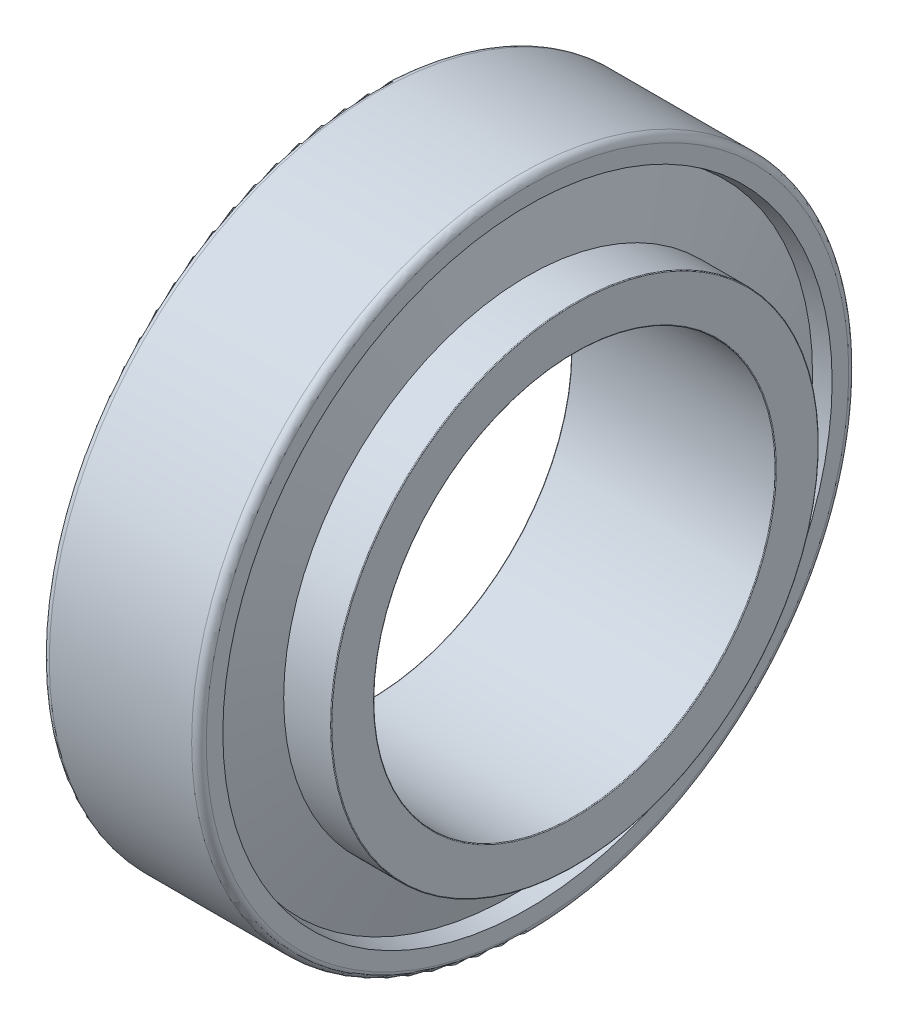
ISO-10303-21;
HEADER;
FILE_DESCRIPTION(('STEP AP214'),'2;1');
FILE_NAME('part.step','',(''),(''),'','','');
FILE_SCHEMA(('AUTOMOTIVE_DESIGN { 1 0 10303 214 1 1 1 1 }'));
ENDSEC;
DATA;
#1=APPLICATION_CONTEXT('core data for automotive mechanical design processes');
#2=APPLICATION_PROTOCOL_DEFINITION('international standard','automotive_design',2000,#1);
#3=PRODUCT_CONTEXT('',#1,'mechanical');
#4=PRODUCT('Part','Part','',(#3));
#5=PRODUCT_RELATED_PRODUCT_CATEGORY('part','',(#4));
#6=PRODUCT_DEFINITION_FORMATION('','',#4);
#7=PRODUCT_DEFINITION_CONTEXT('part definition',#1,'design');
#8=PRODUCT_DEFINITION('design','',#6,#7);
#9=PRODUCT_DEFINITION_SHAPE('','',#8);
#10=(LENGTH_UNIT() NAMED_UNIT(*) SI_UNIT(.MILLI.,.METRE.));
#11=(NAMED_UNIT(*) PLANE_ANGLE_UNIT() SI_UNIT($,.RADIAN.));
#12=(NAMED_UNIT(*) SI_UNIT($,.STERADIAN.) SOLID_ANGLE_UNIT());
#13=UNCERTAINTY_MEASURE_WITH_UNIT(LENGTH_MEASURE(1.E-05),#10,'distance_accuracy_value','');
#14=(GEOMETRIC_REPRESENTATION_CONTEXT(3) GLOBAL_UNCERTAINTY_ASSIGNED_CONTEXT((#13)) GLOBAL_UNIT_ASSIGNED_CONTEXT((#10,
#11,#12)) REPRESENTATION_CONTEXT('',''));
#15=CARTESIAN_POINT('',(0.,0.,0.));
#16=DIRECTION('',(0.,0.,1.));
#17=DIRECTION('',(1.,0.,0.));
#18=AXIS2_PLACEMENT_3D('',#15,#16,#17);
#19=CARTESIAN_POINT('',(5.67383534325749,0.,0.));
#20=DIRECTION('',(-1.,0.,0.));
#21=DIRECTION('',(0.,0.,1.));
#22=AXIS2_PLACEMENT_3D('',#19,#20,#21);
#23=CONICAL_SURFACE('',#22,75.7371115484623,1.29881585169244);
#24=CARTESIAN_POINT('',(11.3476706865151,0.,0.));
#25=DIRECTION('',(-1.,0.,0.));
#26=DIRECTION('',(0.,0.,1.));
#27=AXIS2_PLACEMENT_3D('',#24,#25,#26);
#28=CIRCLE('',#27,55.3928708779656);
#29=CARTESIAN_POINT('',(11.3476706865151,0.,55.3928708779656));
#30=VERTEX_POINT('',#29);
#31=EDGE_CURVE('E111',#30,#30,#28,.T.);
#32=ORIENTED_EDGE('',*,*,#31,.F.);
#33=EDGE_LOOP('',(#32));
#34=FACE_BOUND('',#33,.T.);
#35=CARTESIAN_POINT('',(5.67383534325749,0.,0.));
#36=DIRECTION('',(-1.,0.,0.));
#37=DIRECTION('',(0.,0.,1.));
#38=AXIS2_PLACEMENT_3D('',#35,#36,#37);
#39=CIRCLE('',#38,75.7371115484623);
#40=CARTESIAN_POINT('',(5.67383534325749,0.,75.7371115484623));
#41=VERTEX_POINT('',#40);
#42=EDGE_CURVE('E10',#41,#41,#39,.T.);
#43=ORIENTED_EDGE('',*,*,#42,.T.);
#44=EDGE_LOOP('',(#43));
#45=FACE_BOUND('',#44,.T.);
#46=ADVANCED_FACE('F36',(#34,#45),#23,.F.);
#47=CARTESIAN_POINT('',(0.,0.,0.));
#48=DIRECTION('',(1.,0.,0.));
#49=DIRECTION('',(0.,0.,-1.));
#50=AXIS2_PLACEMENT_3D('',#47,#48,#49);
#51=CONICAL_SURFACE('',#50,74.5635,0.203969739619859);
#52=ORIENTED_EDGE('',*,*,#42,.F.);
#53=EDGE_LOOP('',(#52));
#54=FACE_BOUND('',#53,.T.);
#55=CARTESIAN_POINT('',(0.,0.,0.));
#56=DIRECTION('',(-1.,0.,0.));
#57=DIRECTION('',(0.,0.,1.));
#58=AXIS2_PLACEMENT_3D('',#55,#56,#57);
#59=CIRCLE('',#58,74.5635);
#60=CARTESIAN_POINT('',(0.,0.,74.5635));
#61=VERTEX_POINT('',#60);
#62=EDGE_CURVE('E43',#61,#61,#59,.T.);
#63=ORIENTED_EDGE('',*,*,#62,.T.);
#64=EDGE_LOOP('',(#63));
#65=FACE_BOUND('',#64,.T.);
#66=ADVANCED_FACE('F119',(#54,#65),#51,.F.);
#67=CARTESIAN_POINT('',(0.,74.5635,0.));
#68=DIRECTION('',(1.,0.,0.));
#69=DIRECTION('',(0.,0.,-1.));
#70=AXIS2_PLACEMENT_3D('',#67,#68,#69);
#71=PLANE('',#70);
#72=ORIENTED_EDGE('',*,*,#62,.F.);
#73=EDGE_LOOP('',(#72));
#74=FACE_BOUND('',#73,.T.);
#75=CARTESIAN_POINT('',(0.,0.,0.));
#76=DIRECTION('',(-1.,0.,0.));
#77=DIRECTION('',(0.,0.,1.));
#78=AXIS2_PLACEMENT_3D('',#75,#76,#77);
#79=CIRCLE('',#78,88.);
#80=CARTESIAN_POINT('',(0.,0.,88.));
#81=VERTEX_POINT('',#80);
#82=EDGE_CURVE('E48',#81,#81,#79,.T.);
#83=ORIENTED_EDGE('',*,*,#82,.T.);
#84=EDGE_LOOP('',(#83));
#85=FACE_BOUND('',#84,.T.);
#86=ADVANCED_FACE('F123',(#74,#85),#71,.F.);
#87=CARTESIAN_POINT('',(2.,0.,0.));
#88=DIRECTION('',(-1.,0.,0.));
#89=DIRECTION('',(0.,0.,1.));
#90=AXIS2_PLACEMENT_3D('',#87,#88,#89);
#91=TOROIDAL_SURFACE('',#90,88.,2.);
#92=ORIENTED_EDGE('',*,*,#82,.F.);
#93=EDGE_LOOP('',(#92));
#94=FACE_BOUND('',#93,.T.);
#95=CARTESIAN_POINT('',(2.,0.,0.));
#96=DIRECTION('',(-1.,0.,0.));
#97=DIRECTION('',(0.,0.,1.));
#98=AXIS2_PLACEMENT_3D('',#95,#96,#97);
#99=CIRCLE('',#98,90.);
#100=CARTESIAN_POINT('',(2.,0.,90.));
#101=VERTEX_POINT('',#100);
#102=EDGE_CURVE('E53',#101,#101,#99,.T.);
#103=ORIENTED_EDGE('',*,*,#102,.T.);
#104=EDGE_LOOP('',(#103));
#105=FACE_BOUND('',#104,.T.);
#106=ADVANCED_FACE('F128',(#94,#105),#91,.T.);
#107=CARTESIAN_POINT('',(-882.527700014444,0.,0.));
#108=DIRECTION('',(-1.,0.,0.));
#109=DIRECTION('',(0.,0.,1.));
#110=AXIS2_PLACEMENT_3D('',#107,#108,#109);
#111=CYLINDRICAL_SURFACE('',#110,90.);
#112=ORIENTED_EDGE('',*,*,#102,.F.);
#113=EDGE_LOOP('',(#112));
#114=FACE_BOUND('',#113,.T.);
#115=CARTESIAN_POINT('',(41.,0.,0.));
#116=DIRECTION('',(-1.,0.,0.));
#117=DIRECTION('',(0.,0.,1.));
#118=AXIS2_PLACEMENT_3D('',#115,#116,#117);
#119=CIRCLE('',#118,90.);
#120=CARTESIAN_POINT('',(41.,0.,90.));
#121=VERTEX_POINT('',#120);
#122=EDGE_CURVE('E59',#121,#121,#119,.T.);
#123=ORIENTED_EDGE('',*,*,#122,.T.);
#124=EDGE_LOOP('',(#123));
#125=FACE_BOUND('',#124,.T.);
#126=ADVANCED_FACE('F134',(#114,#125),#111,.T.);
#127=CARTESIAN_POINT('',(41.,0.,0.));
#128=DIRECTION('',(-1.,0.,0.));
#129=DIRECTION('',(0.,0.,1.));
#130=AXIS2_PLACEMENT_3D('',#127,#128,#129);
#131=TOROIDAL_SURFACE('',#130,88.,2.00000000000001);
#132=ORIENTED_EDGE('',*,*,#122,.F.);
#133=EDGE_LOOP('',(#132));
#134=FACE_BOUND('',#133,.T.);
#135=CARTESIAN_POINT('',(43.,0.,0.));
#136=DIRECTION('',(-1.,0.,0.));
#137=DIRECTION('',(0.,0.,1.));
#138=AXIS2_PLACEMENT_3D('',#135,#136,#137);
#139=CIRCLE('',#138,88.);
#140=CARTESIAN_POINT('',(43.,0.,88.));
#141=VERTEX_POINT('',#140);
#142=EDGE_CURVE('E63',#141,#141,#139,.T.);
#143=ORIENTED_EDGE('',*,*,#142,.T.);
#144=EDGE_LOOP('',(#143));
#145=FACE_BOUND('',#144,.T.);
#146=ADVANCED_FACE('F138',(#134,#145),#131,.T.);
#147=CARTESIAN_POINT('',(43.,88.,0.));
#148=DIRECTION('',(-1.,0.,0.));
#149=DIRECTION('',(0.,0.,1.));
#150=AXIS2_PLACEMENT_3D('',#147,#148,#149);
#151=PLANE('',#150);
#152=ORIENTED_EDGE('',*,*,#142,.F.);
#153=EDGE_LOOP('',(#152));
#154=FACE_BOUND('',#153,.T.);
#155=CARTESIAN_POINT('',(43.,0.,0.));
#156=DIRECTION('',(-1.,0.,0.));
#157=DIRECTION('',(0.,0.,1.));
#158=AXIS2_PLACEMENT_3D('',#155,#156,#157);
#159=CIRCLE('',#158,83.4578886332282);
#160=CARTESIAN_POINT('',(43.,0.,83.4578886332282));
#161=VERTEX_POINT('',#160);
#162=EDGE_CURVE('E67',#161,#161,#159,.T.);
#163=ORIENTED_EDGE('',*,*,#162,.T.);
#164=EDGE_LOOP('',(#163));
#165=FACE_BOUND('',#164,.T.);
#166=ADVANCED_FACE('F142',(#154,#165),#151,.F.);
#167=CARTESIAN_POINT('',(38.5520457295194,0.,0.));
#168=DIRECTION('',(1.,0.,0.));
#169=DIRECTION('',(0.,0.,-1.));
#170=AXIS2_PLACEMENT_3D('',#167,#168,#169);
#171=CONICAL_SURFACE('',#170,82.5378459842868,0.203969739619856);
#172=ORIENTED_EDGE('',*,*,#162,.F.);
#173=EDGE_LOOP('',(#172));
#174=FACE_BOUND('',#173,.T.);
#175=CARTESIAN_POINT('',(38.5520457295194,0.,0.));
#176=DIRECTION('',(-1.,0.,0.));
#177=DIRECTION('',(0.,0.,1.));
#178=AXIS2_PLACEMENT_3D('',#175,#176,#177);
#179=CIRCLE('',#178,82.5378459842868);
#180=CARTESIAN_POINT('',(38.5520457295194,0.,82.5378459842868));
#181=VERTEX_POINT('',#180);
#182=EDGE_CURVE('E71',#181,#181,#179,.T.);
#183=ORIENTED_EDGE('',*,*,#182,.T.);
#184=EDGE_LOOP('',(#183));
#185=FACE_BOUND('',#184,.T.);
#186=ADVANCED_FACE('F146',(#174,#185),#171,.F.);
#187=CARTESIAN_POINT('',(43.,0.,0.));
#188=DIRECTION('',(-1.,0.,0.));
#189=DIRECTION('',(0.,0.,1.));
#190=AXIS2_PLACEMENT_3D('',#187,#188,#189);
#191=CONICAL_SURFACE('',#190,66.5891540157132,1.29881585169244);
#192=ORIENTED_EDGE('',*,*,#182,.F.);
#193=EDGE_LOOP('',(#192));
#194=FACE_BOUND('',#193,.T.);
#195=CARTESIAN_POINT('',(43.,0.,0.));
#196=DIRECTION('',(-1.,0.,0.));
#197=DIRECTION('',(0.,0.,1.));
#198=AXIS2_PLACEMENT_3D('',#195,#196,#197);
#199=CIRCLE('',#198,66.5891540157132);
#200=CARTESIAN_POINT('',(43.,0.,66.5891540157132));
#201=VERTEX_POINT('',#200);
#202=EDGE_CURVE('E75',#201,#201,#199,.T.);
#203=ORIENTED_EDGE('',*,*,#202,.T.);
#204=EDGE_LOOP('',(#203));
#205=FACE_BOUND('',#204,.T.);
#206=ADVANCED_FACE('F150',(#194,#205),#191,.T.);
#207=CARTESIAN_POINT('',(43.,66.7891540157132,0.));
#208=DIRECTION('',(1.,0.,0.));
#209=DIRECTION('',(0.,0.,-1.));
#210=AXIS2_PLACEMENT_3D('',#207,#208,#209);
#211=PLANE('',#210);
#212=ORIENTED_EDGE('',*,*,#202,.F.);
#213=EDGE_LOOP('',(#212));
#214=FACE_BOUND('',#213,.T.);
#215=CARTESIAN_POINT('',(43.,0.,0.));
#216=DIRECTION('',(-1.,0.,0.));
#217=DIRECTION('',(0.,0.,1.));
#218=AXIS2_PLACEMENT_3D('',#215,#216,#217);
#219=CIRCLE('',#218,66.7891540157132);
#220=CARTESIAN_POINT('',(43.,0.,66.7891540157132));
#221=VERTEX_POINT('',#220);
#222=EDGE_CURVE('E79',#221,#221,#219,.T.);
#223=ORIENTED_EDGE('',*,*,#222,.T.);
#224=EDGE_LOOP('',(#223));
#225=FACE_BOUND('',#224,.T.);
#226=ADVANCED_FACE('F154',(#214,#225),#211,.F.);
#227=CARTESIAN_POINT('',(-882.527700014444,0.,0.));
#228=DIRECTION('',(-1.,0.,0.));
#229=DIRECTION('',(0.,0.,1.));
#230=AXIS2_PLACEMENT_3D('',#227,#228,#229);
#231=CYLINDRICAL_SURFACE('',#230,66.7891540157132);
#232=ORIENTED_EDGE('',*,*,#222,.F.);
#233=EDGE_LOOP('',(#232));
#234=FACE_BOUND('',#233,.T.);
#235=CARTESIAN_POINT('',(55.8,0.,0.));
#236=DIRECTION('',(-1.,0.,0.));
#237=DIRECTION('',(0.,0.,1.));
#238=AXIS2_PLACEMENT_3D('',#235,#236,#237);
#239=CIRCLE('',#238,66.7891540157132);
#240=CARTESIAN_POINT('',(55.8,0.,66.7891540157132));
#241=VERTEX_POINT('',#240);
#242=EDGE_CURVE('E83',#241,#241,#239,.T.);
#243=ORIENTED_EDGE('',*,*,#242,.T.);
#244=EDGE_LOOP('',(#243));
#245=FACE_BOUND('',#244,.T.);
#246=ADVANCED_FACE('F158',(#234,#245),#231,.T.);
#247=CARTESIAN_POINT('',(55.8,0.,0.));
#248=DIRECTION('',(-1.,0.,0.));
#249=DIRECTION('',(0.,0.,1.));
#250=AXIS2_PLACEMENT_3D('',#247,#248,#249);
#251=TOROIDAL_SURFACE('',#250,66.5891540157132,0.199999999999999);
#252=ORIENTED_EDGE('',*,*,#242,.F.);
#253=EDGE_LOOP('',(#252));
#254=FACE_BOUND('',#253,.T.);
#255=CARTESIAN_POINT('',(56.,0.,0.));
#256=DIRECTION('',(-1.,0.,0.));
#257=DIRECTION('',(0.,0.,1.));
#258=AXIS2_PLACEMENT_3D('',#255,#256,#257);
#259=CIRCLE('',#258,66.5891540157132);
#260=CARTESIAN_POINT('',(56.,0.,66.5891540157132));
#261=VERTEX_POINT('',#260);
#262=EDGE_CURVE('E87',#261,#261,#259,.T.);
#263=ORIENTED_EDGE('',*,*,#262,.T.);
#264=EDGE_LOOP('',(#263));
#265=FACE_BOUND('',#264,.T.);
#266=ADVANCED_FACE('F162',(#254,#265),#251,.T.);
#267=CARTESIAN_POINT('',(56.,55.2,0.));
#268=DIRECTION('',(-1.,0.,0.));
#269=DIRECTION('',(0.,0.,1.));
#270=AXIS2_PLACEMENT_3D('',#267,#268,#269);
#271=PLANE('',#270);
#272=ORIENTED_EDGE('',*,*,#262,.F.);
#273=EDGE_LOOP('',(#272));
#274=FACE_BOUND('',#273,.T.);
#275=CARTESIAN_POINT('',(56.,0.,0.));
#276=DIRECTION('',(-1.,0.,0.));
#277=DIRECTION('',(0.,0.,1.));
#278=AXIS2_PLACEMENT_3D('',#275,#276,#277);
#279=CIRCLE('',#278,55.2);
#280=CARTESIAN_POINT('',(56.,0.,55.2));
#281=VERTEX_POINT('',#280);
#282=EDGE_CURVE('E91',#281,#281,#279,.T.);
#283=ORIENTED_EDGE('',*,*,#282,.T.);
#284=EDGE_LOOP('',(#283));
#285=FACE_BOUND('',#284,.T.);
#286=ADVANCED_FACE('F166',(#274,#285),#271,.F.);
#287=CARTESIAN_POINT('',(55.8,0.,0.));
#288=DIRECTION('',(-1.,0.,0.));
#289=DIRECTION('',(0.,0.,1.));
#290=AXIS2_PLACEMENT_3D('',#287,#288,#289);
#291=TOROIDAL_SURFACE('',#290,55.2,0.199999999999999);
#292=ORIENTED_EDGE('',*,*,#282,.F.);
#293=EDGE_LOOP('',(#292));
#294=FACE_BOUND('',#293,.T.);
#295=CARTESIAN_POINT('',(55.8,0.,0.));
#296=DIRECTION('',(-1.,0.,0.));
#297=DIRECTION('',(0.,0.,1.));
#298=AXIS2_PLACEMENT_3D('',#295,#296,#297);
#299=CIRCLE('',#298,55.);
#300=CARTESIAN_POINT('',(55.8,0.,55.));
#301=VERTEX_POINT('',#300);
#302=EDGE_CURVE('E95',#301,#301,#299,.T.);
#303=ORIENTED_EDGE('',*,*,#302,.T.);
#304=EDGE_LOOP('',(#303));
#305=FACE_BOUND('',#304,.T.);
#306=ADVANCED_FACE('F170',(#294,#305),#291,.T.);
#307=CARTESIAN_POINT('',(-882.527700014444,0.,0.));
#308=DIRECTION('',(-1.,0.,0.));
#309=DIRECTION('',(0.,0.,1.));
#310=AXIS2_PLACEMENT_3D('',#307,#308,#309);
#311=CYLINDRICAL_SURFACE('',#310,55.);
#312=ORIENTED_EDGE('',*,*,#302,.F.);
#313=EDGE_LOOP('',(#312));
#314=FACE_BOUND('',#313,.T.);
#315=CARTESIAN_POINT('',(0.199999999999978,0.,0.));
#316=DIRECTION('',(-1.,0.,0.));
#317=DIRECTION('',(0.,0.,1.));
#318=AXIS2_PLACEMENT_3D('',#315,#316,#317);
#319=CIRCLE('',#318,55.);
#320=CARTESIAN_POINT('',(0.199999999999978,0.,55.));
#321=VERTEX_POINT('',#320);
#322=EDGE_CURVE('E99',#321,#321,#319,.T.);
#323=ORIENTED_EDGE('',*,*,#322,.T.);
#324=EDGE_LOOP('',(#323));
#325=FACE_BOUND('',#324,.T.);
#326=ADVANCED_FACE('F174',(#314,#325),#311,.F.);
#327=CARTESIAN_POINT('',(0.200000000000001,0.,0.));
#328=DIRECTION('',(-1.,0.,0.));
#329=DIRECTION('',(0.,0.,1.));
#330=AXIS2_PLACEMENT_3D('',#327,#328,#329);
#331=TOROIDAL_SURFACE('',#330,55.2,0.200000000000003);
#332=ORIENTED_EDGE('',*,*,#322,.F.);
#333=EDGE_LOOP('',(#332));
#334=FACE_BOUND('',#333,.T.);
#335=CARTESIAN_POINT('',(0.,0.,0.));
#336=DIRECTION('',(-1.,0.,0.));
#337=DIRECTION('',(0.,0.,1.));
#338=AXIS2_PLACEMENT_3D('',#335,#336,#337);
#339=CIRCLE('',#338,55.2);
#340=CARTESIAN_POINT('',(0.,0.,55.2));
#341=VERTEX_POINT('',#340);
#342=EDGE_CURVE('E103',#341,#341,#339,.T.);
#343=ORIENTED_EDGE('',*,*,#342,.T.);
#344=EDGE_LOOP('',(#343));
#345=FACE_BOUND('',#344,.T.);
#346=ADVANCED_FACE('F178',(#334,#345),#331,.T.);
#347=CARTESIAN_POINT('',(0.,55.3928708779656,0.));
#348=DIRECTION('',(1.,0.,0.));
#349=DIRECTION('',(0.,0.,-1.));
#350=AXIS2_PLACEMENT_3D('',#347,#348,#349);
#351=PLANE('',#350);
#352=ORIENTED_EDGE('',*,*,#342,.F.);
#353=EDGE_LOOP('',(#352));
#354=FACE_BOUND('',#353,.T.);
#355=CARTESIAN_POINT('',(0.,0.,0.));
#356=DIRECTION('',(-1.,0.,0.));
#357=DIRECTION('',(0.,0.,1.));
#358=AXIS2_PLACEMENT_3D('',#355,#356,#357);
#359=CIRCLE('',#358,55.3928708779656);
#360=CARTESIAN_POINT('',(0.,0.,55.3928708779656));
#361=VERTEX_POINT('',#360);
#362=EDGE_CURVE('E107',#361,#361,#359,.T.);
#363=ORIENTED_EDGE('',*,*,#362,.T.);
#364=EDGE_LOOP('',(#363));
#365=FACE_BOUND('',#364,.T.);
#366=ADVANCED_FACE('F182',(#354,#365),#351,.F.);
#367=CARTESIAN_POINT('',(-882.527700014444,0.,0.));
#368=DIRECTION('',(-1.,0.,0.));
#369=DIRECTION('',(0.,0.,1.));
#370=AXIS2_PLACEMENT_3D('',#367,#368,#369);
#371=CYLINDRICAL_SURFACE('',#370,55.3928708779656);
#372=ORIENTED_EDGE('',*,*,#362,.F.);
#373=EDGE_LOOP('',(#372));
#374=FACE_BOUND('',#373,.T.);
#375=ORIENTED_EDGE('',*,*,#31,.T.);
#376=EDGE_LOOP('',(#375));
#377=FACE_BOUND('',#376,.T.);
#378=ADVANCED_FACE('F116',(#374,#377),#371,.T.);
#379=CLOSED_SHELL('',(#46,#66,#86,#106,#126,#146,#166,#186,#206,#226,#246,#266,#286,#306,#326,
#346,#366,#378));
#380=MANIFOLD_SOLID_BREP('B2',#379);
#381=ADVANCED_BREP_SHAPE_REPRESENTATION('',(#18,#380),#14);
#382=SHAPE_DEFINITION_REPRESENTATION(#9,#381);
ENDSEC;
END-ISO-10303-21;
